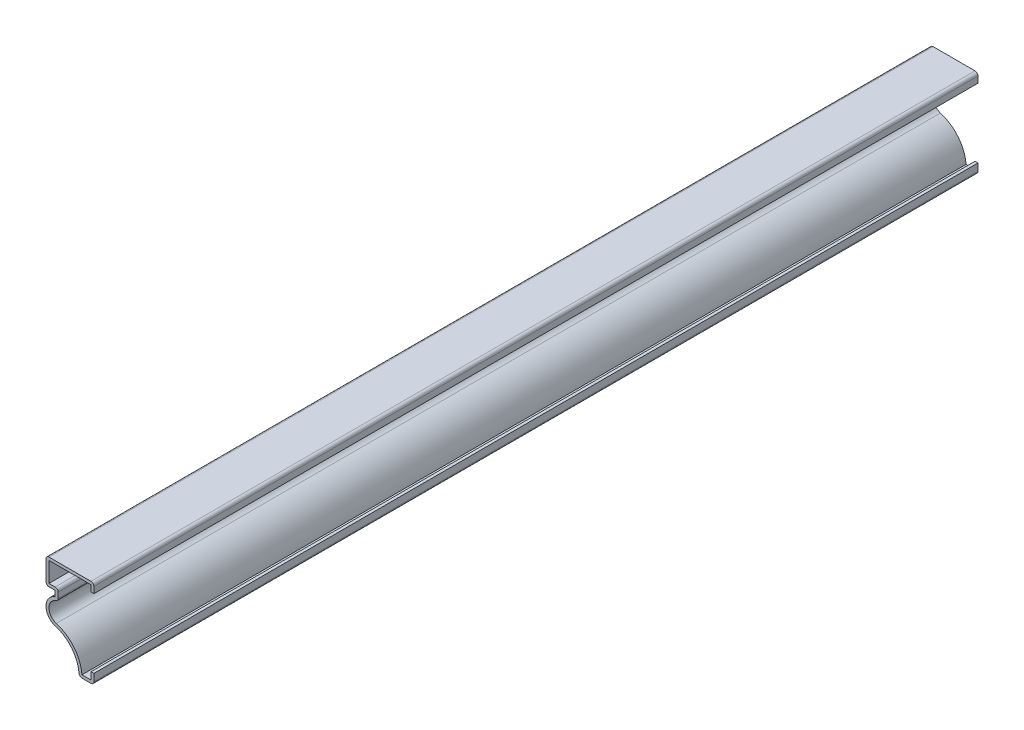
ISO-10303-21;
HEADER;
FILE_DESCRIPTION(('STEP AP214'),'2;1');
FILE_NAME('part.step','',(''),(''),'','','');
FILE_SCHEMA(('AUTOMOTIVE_DESIGN { 1 0 10303 214 1 1 1 1 }'));
ENDSEC;
DATA;
#1=APPLICATION_CONTEXT('core data for automotive mechanical design processes');
#2=APPLICATION_PROTOCOL_DEFINITION('international standard','automotive_design',2000,#1);
#3=PRODUCT_CONTEXT('',#1,'mechanical');
#4=PRODUCT('Part','Part','',(#3));
#5=PRODUCT_RELATED_PRODUCT_CATEGORY('part','',(#4));
#6=PRODUCT_DEFINITION_FORMATION('','',#4);
#7=PRODUCT_DEFINITION_CONTEXT('part definition',#1,'design');
#8=PRODUCT_DEFINITION('design','',#6,#7);
#9=PRODUCT_DEFINITION_SHAPE('','',#8);
#10=(LENGTH_UNIT() NAMED_UNIT(*) SI_UNIT(.MILLI.,.METRE.));
#11=(NAMED_UNIT(*) PLANE_ANGLE_UNIT() SI_UNIT($,.RADIAN.));
#12=(NAMED_UNIT(*) SI_UNIT($,.STERADIAN.) SOLID_ANGLE_UNIT());
#13=UNCERTAINTY_MEASURE_WITH_UNIT(LENGTH_MEASURE(1.E-05),#10,'distance_accuracy_value','');
#14=(GEOMETRIC_REPRESENTATION_CONTEXT(3) GLOBAL_UNCERTAINTY_ASSIGNED_CONTEXT((#13)) GLOBAL_UNIT_ASSIGNED_CONTEXT((#10,
#11,#12)) REPRESENTATION_CONTEXT('',''));
#15=CARTESIAN_POINT('',(0.,0.,0.));
#16=DIRECTION('',(0.,0.,1.));
#17=DIRECTION('',(1.,0.,0.));
#18=AXIS2_PLACEMENT_3D('',#15,#16,#17);
#19=CARTESIAN_POINT('',(0.,0.,-381.));
#20=DIRECTION('',(1.,0.,0.));
#21=DIRECTION('',(0.,0.,-1.));
#22=AXIS2_PLACEMENT_3D('',#19,#20,#21);
#23=PLANE('',#22);
#24=DIRECTION('',(0.,1.,0.));
#25=VECTOR('',#24,1.);
#26=CARTESIAN_POINT('',(0.,0.,0.));
#27=LINE('',#26,#25);
#28=CARTESIAN_POINT('',(0.,1.27,0.));
#29=VERTEX_POINT('',#28);
#30=CARTESIAN_POINT('',(0.,4.365625,0.));
#31=VERTEX_POINT('',#30);
#32=EDGE_CURVE('E380',#29,#31,#27,.T.);
#33=ORIENTED_EDGE('',*,*,#32,.F.);
#34=DIRECTION('',(0.,0.,1.));
#35=VECTOR('',#34,1.);
#36=CARTESIAN_POINT('',(0.,1.27,-381.));
#37=LINE('',#36,#35);
#38=CARTESIAN_POINT('',(0.,1.27,-381.));
#39=VERTEX_POINT('',#38);
#40=EDGE_CURVE('E222',#29,#39,#37,.F.);
#41=ORIENTED_EDGE('',*,*,#40,.T.);
#42=DIRECTION('',(0.,1.,0.));
#43=VECTOR('',#42,1.);
#44=CARTESIAN_POINT('',(0.,0.,-381.));
#45=LINE('',#44,#43);
#46=CARTESIAN_POINT('',(0.,4.365625,-381.));
#47=VERTEX_POINT('',#46);
#48=EDGE_CURVE('E215',#39,#47,#45,.T.);
#49=ORIENTED_EDGE('',*,*,#48,.T.);
#50=DIRECTION('',(0.,0.,1.));
#51=VECTOR('',#50,1.);
#52=CARTESIAN_POINT('',(0.,4.365625,-381.));
#53=LINE('',#52,#51);
#54=EDGE_CURVE('E219',#47,#31,#53,.T.);
#55=ORIENTED_EDGE('',*,*,#54,.T.);
#56=EDGE_LOOP('',(#33,#41,#49,#55));
#57=FACE_BOUND('',#56,.T.);
#58=ADVANCED_FACE('F35',(#57),#23,.T.);
#59=CARTESIAN_POINT('',(-6.35,0.,-381.));
#60=DIRECTION('',(0.,-1.,0.));
#61=DIRECTION('',(0.,0.,-1.));
#62=AXIS2_PLACEMENT_3D('',#59,#60,#61);
#63=PLANE('',#62);
#64=DIRECTION('',(1.,0.,0.));
#65=VECTOR('',#64,1.);
#66=CARTESIAN_POINT('',(-6.35,0.,-381.));
#67=LINE('',#66,#65);
#68=CARTESIAN_POINT('',(-5.13192338221503,0.,-381.));
#69=VERTEX_POINT('',#68);
#70=CARTESIAN_POINT('',(-1.27,0.,-381.));
#71=VERTEX_POINT('',#70);
#72=EDGE_CURVE('E240',#69,#71,#67,.T.);
#73=ORIENTED_EDGE('',*,*,#72,.T.);
#74=DIRECTION('',(0.,0.,1.));
#75=VECTOR('',#74,1.);
#76=CARTESIAN_POINT('',(-1.27,0.,-381.));
#77=LINE('',#76,#75);
#78=CARTESIAN_POINT('',(-1.27,0.,0.));
#79=VERTEX_POINT('',#78);
#80=EDGE_CURVE('E287',#71,#79,#77,.T.);
#81=ORIENTED_EDGE('',*,*,#80,.T.);
#82=DIRECTION('',(1.,0.,0.));
#83=VECTOR('',#82,1.);
#84=CARTESIAN_POINT('',(-6.35,0.,0.));
#85=LINE('',#84,#83);
#86=CARTESIAN_POINT('',(-5.13192338221503,0.,0.));
#87=VERTEX_POINT('',#86);
#88=EDGE_CURVE('E225',#87,#79,#85,.T.);
#89=ORIENTED_EDGE('',*,*,#88,.F.);
#90=DIRECTION('',(0.,0.,1.));
#91=VECTOR('',#90,1.);
#92=CARTESIAN_POINT('',(-5.13192338221503,0.,-381.));
#93=LINE('',#92,#91);
#94=EDGE_CURVE('E285',#87,#69,#93,.F.);
#95=ORIENTED_EDGE('',*,*,#94,.T.);
#96=EDGE_LOOP('',(#73,#81,#89,#95));
#97=FACE_BOUND('',#96,.T.);
#98=ADVANCED_FACE('F441',(#97),#63,.T.);
#99=CARTESIAN_POINT('',(-20.6375,0.,-381.));
#100=DIRECTION('',(0.,0.,1.));
#101=DIRECTION('',(1.,0.,0.));
#102=AXIS2_PLACEMENT_3D('',#99,#100,#101);
#103=CYLINDRICAL_SURFACE('',#102,14.2875);
#104=CARTESIAN_POINT('',(-20.6375,0.,-381.));
#105=DIRECTION('',(0.,0.,-1.));
#106=DIRECTION('',(-1.,0.,0.));
#107=AXIS2_PLACEMENT_3D('',#104,#105,#106);
#108=CIRCLE('',#107,14.2875);
#109=CARTESIAN_POINT('',(-16.5567820989189,13.6923481427327,-381.));
#110=VERTEX_POINT('',#109);
#111=CARTESIAN_POINT('',(-6.39768473876891,1.16632653061224,-381.));
#112=VERTEX_POINT('',#111);
#113=EDGE_CURVE('E245',#110,#112,#108,.T.);
#114=ORIENTED_EDGE('',*,*,#113,.T.);
#115=DIRECTION('',(0.,0.,1.));
#116=VECTOR('',#115,1.);
#117=CARTESIAN_POINT('',(-6.3976847387689,1.16632653061224,-381.));
#118=LINE('',#117,#116);
#119=CARTESIAN_POINT('',(-6.39768473876891,1.16632653061224,0.));
#120=VERTEX_POINT('',#119);
#121=EDGE_CURVE('E291',#112,#120,#118,.T.);
#122=ORIENTED_EDGE('',*,*,#121,.T.);
#123=CARTESIAN_POINT('',(-20.6375,0.,0.));
#124=DIRECTION('',(0.,0.,-1.));
#125=DIRECTION('',(-1.,0.,0.));
#126=AXIS2_PLACEMENT_3D('',#123,#124,#125);
#127=CIRCLE('',#126,14.2875);
#128=CARTESIAN_POINT('',(-16.5567820989189,13.6923481427327,0.));
#129=VERTEX_POINT('',#128);
#130=EDGE_CURVE('E336',#129,#120,#127,.T.);
#131=ORIENTED_EDGE('',*,*,#130,.F.);
#132=DIRECTION('',(0.,0.,1.));
#133=VECTOR('',#132,1.);
#134=CARTESIAN_POINT('',(-16.5567820989189,13.6923481427327,-381.));
#135=LINE('',#134,#133);
#136=EDGE_CURVE('E253',#110,#129,#135,.T.);
#137=ORIENTED_EDGE('',*,*,#136,.F.);
#138=EDGE_LOOP('',(#114,#122,#131,#137));
#139=FACE_BOUND('',#138,.T.);
#140=ADVANCED_FACE('F450',(#139),#103,.F.);
#141=CARTESIAN_POINT('',(-14.9252925239659,19.1666111996272,-381.));
#142=DIRECTION('',(0.,0.,1.));
#143=DIRECTION('',(1.,0.,0.));
#144=AXIS2_PLACEMENT_3D('',#141,#142,#143);
#145=CYLINDRICAL_SURFACE('',#144,5.71220747603415);
#146=CARTESIAN_POINT('',(-14.9252925239659,19.1666111996272,0.));
#147=DIRECTION('',(0.,0.,1.));
#148=DIRECTION('',(1.,0.,0.));
#149=AXIS2_PLACEMENT_3D('',#146,#147,#148);
#150=CIRCLE('',#149,5.71220747603415);
#151=CARTESIAN_POINT('',(-16.66875,24.60625,0.));
#152=VERTEX_POINT('',#151);
#153=EDGE_CURVE('E333',#152,#129,#150,.T.);
#154=ORIENTED_EDGE('',*,*,#153,.F.);
#155=DIRECTION('',(0.,0.,1.));
#156=VECTOR('',#155,1.);
#157=CARTESIAN_POINT('',(-16.66875,24.60625,-381.));
#158=LINE('',#157,#156);
#159=CARTESIAN_POINT('',(-16.66875,24.60625,-381.));
#160=VERTEX_POINT('',#159);
#161=EDGE_CURVE('E342',#160,#152,#158,.T.);
#162=ORIENTED_EDGE('',*,*,#161,.F.);
#163=CARTESIAN_POINT('',(-14.9252925239659,19.1666111996272,-381.));
#164=DIRECTION('',(0.,0.,1.));
#165=DIRECTION('',(1.,0.,0.));
#166=AXIS2_PLACEMENT_3D('',#163,#164,#165);
#167=CIRCLE('',#166,5.71220747603415);
#168=EDGE_CURVE('E431',#160,#110,#167,.T.);
#169=ORIENTED_EDGE('',*,*,#168,.T.);
#170=ORIENTED_EDGE('',*,*,#136,.T.);
#171=EDGE_LOOP('',(#154,#162,#169,#170));
#172=FACE_BOUND('',#171,.T.);
#173=ADVANCED_FACE('F454',(#172),#145,.T.);
#174=CARTESIAN_POINT('',(-16.66875,26.9875,-381.));
#175=DIRECTION('',(-1.,0.,0.));
#176=DIRECTION('',(0.,0.,1.));
#177=AXIS2_PLACEMENT_3D('',#174,#175,#176);
#178=PLANE('',#177);
#179=DIRECTION('',(0.,-1.,0.));
#180=VECTOR('',#179,1.);
#181=CARTESIAN_POINT('',(-16.66875,26.9875,0.));
#182=LINE('',#181,#180);
#183=CARTESIAN_POINT('',(-16.66875,26.9875,0.));
#184=VERTEX_POINT('',#183);
#185=EDGE_CURVE('E325',#184,#152,#182,.T.);
#186=ORIENTED_EDGE('',*,*,#185,.F.);
#187=DIRECTION('',(0.,0.,1.));
#188=VECTOR('',#187,1.);
#189=CARTESIAN_POINT('',(-16.66875,26.9875,-381.));
#190=LINE('',#189,#188);
#191=CARTESIAN_POINT('',(-16.66875,26.9875,-381.));
#192=VERTEX_POINT('',#191);
#193=EDGE_CURVE('E344',#192,#184,#190,.T.);
#194=ORIENTED_EDGE('',*,*,#193,.F.);
#195=DIRECTION('',(0.,-1.,0.));
#196=VECTOR('',#195,1.);
#197=CARTESIAN_POINT('',(-16.66875,26.9875,-381.));
#198=LINE('',#197,#196);
#199=EDGE_CURVE('E428',#192,#160,#198,.T.);
#200=ORIENTED_EDGE('',*,*,#199,.T.);
#201=ORIENTED_EDGE('',*,*,#161,.T.);
#202=EDGE_LOOP('',(#186,#194,#200,#201));
#203=FACE_BOUND('',#202,.T.);
#204=ADVANCED_FACE('F460',(#203),#178,.T.);
#205=CARTESIAN_POINT('',(-20.6375,26.9875,-381.));
#206=DIRECTION('',(0.,-1.,0.));
#207=DIRECTION('',(0.,0.,-1.));
#208=AXIS2_PLACEMENT_3D('',#205,#206,#207);
#209=PLANE('',#208);
#210=DIRECTION('',(1.,0.,0.));
#211=VECTOR('',#210,1.);
#212=CARTESIAN_POINT('',(-20.6375,26.9875,0.));
#213=LINE('',#212,#211);
#214=CARTESIAN_POINT('',(-19.3675,26.9875,0.));
#215=VERTEX_POINT('',#214);
#216=EDGE_CURVE('E322',#215,#184,#213,.T.);
#217=ORIENTED_EDGE('',*,*,#216,.F.);
#218=DIRECTION('',(0.,0.,1.));
#219=VECTOR('',#218,1.);
#220=CARTESIAN_POINT('',(-19.3675,26.9875,-381.));
#221=LINE('',#220,#219);
#222=CARTESIAN_POINT('',(-19.3675,26.9875,-381.));
#223=VERTEX_POINT('',#222);
#224=EDGE_CURVE('E11',#215,#223,#221,.F.);
#225=ORIENTED_EDGE('',*,*,#224,.T.);
#226=DIRECTION('',(1.,0.,0.));
#227=VECTOR('',#226,1.);
#228=CARTESIAN_POINT('',(-20.6375,26.9875,-381.));
#229=LINE('',#228,#227);
#230=EDGE_CURVE('E421',#223,#192,#229,.T.);
#231=ORIENTED_EDGE('',*,*,#230,.T.);
#232=ORIENTED_EDGE('',*,*,#193,.T.);
#233=EDGE_LOOP('',(#217,#225,#231,#232));
#234=FACE_BOUND('',#233,.T.);
#235=ADVANCED_FACE('F462',(#234),#209,.T.);
#236=CARTESIAN_POINT('',(-20.6375,38.1,-381.));
#237=DIRECTION('',(-1.,0.,0.));
#238=DIRECTION('',(0.,0.,1.));
#239=AXIS2_PLACEMENT_3D('',#236,#237,#238);
#240=PLANE('',#239);
#241=DIRECTION('',(0.,-1.,0.));
#242=VECTOR('',#241,1.);
#243=CARTESIAN_POINT('',(-20.6375,38.1,-381.));
#244=LINE('',#243,#242);
#245=CARTESIAN_POINT('',(-20.6375,36.83,-381.));
#246=VERTEX_POINT('',#245);
#247=CARTESIAN_POINT('',(-20.6375,28.2575,-381.));
#248=VERTEX_POINT('',#247);
#249=EDGE_CURVE('E314',#246,#248,#244,.T.);
#250=ORIENTED_EDGE('',*,*,#249,.T.);
#251=DIRECTION('',(0.,0.,1.));
#252=VECTOR('',#251,1.);
#253=CARTESIAN_POINT('',(-20.6375,28.2575,-381.));
#254=LINE('',#253,#252);
#255=CARTESIAN_POINT('',(-20.6375,28.2575,0.));
#256=VERTEX_POINT('',#255);
#257=EDGE_CURVE('E43',#248,#256,#254,.T.);
#258=ORIENTED_EDGE('',*,*,#257,.T.);
#259=DIRECTION('',(0.,-1.,0.));
#260=VECTOR('',#259,1.);
#261=CARTESIAN_POINT('',(-20.6375,38.1,0.));
#262=LINE('',#261,#260);
#263=CARTESIAN_POINT('',(-20.6375,36.83,0.));
#264=VERTEX_POINT('',#263);
#265=EDGE_CURVE('E311',#264,#256,#262,.T.);
#266=ORIENTED_EDGE('',*,*,#265,.F.);
#267=DIRECTION('',(0.,0.,1.));
#268=VECTOR('',#267,1.);
#269=CARTESIAN_POINT('',(-20.6375,36.83,-381.));
#270=LINE('',#269,#268);
#271=EDGE_CURVE('E303',#264,#246,#270,.F.);
#272=ORIENTED_EDGE('',*,*,#271,.T.);
#273=EDGE_LOOP('',(#250,#258,#266,#272));
#274=FACE_BOUND('',#273,.T.);
#275=ADVANCED_FACE('F310',(#274),#240,.T.);
#276=CARTESIAN_POINT('',(0.,38.1,-381.));
#277=DIRECTION('',(0.,1.,0.));
#278=DIRECTION('',(0.,0.,1.));
#279=AXIS2_PLACEMENT_3D('',#276,#277,#278);
#280=PLANE('',#279);
#281=DIRECTION('',(-1.,0.,0.));
#282=VECTOR('',#281,1.);
#283=CARTESIAN_POINT('',(0.,38.1,0.));
#284=LINE('',#283,#282);
#285=CARTESIAN_POINT('',(-1.27,38.1,0.));
#286=VERTEX_POINT('',#285);
#287=CARTESIAN_POINT('',(-19.3675,38.1,0.));
#288=VERTEX_POINT('',#287);
#289=EDGE_CURVE('E323',#286,#288,#284,.T.);
#290=ORIENTED_EDGE('',*,*,#289,.F.);
#291=DIRECTION('',(0.,0.,1.));
#292=VECTOR('',#291,1.);
#293=CARTESIAN_POINT('',(-1.27,38.1,-381.));
#294=LINE('',#293,#292);
#295=CARTESIAN_POINT('',(-1.27,38.1,-381.));
#296=VERTEX_POINT('',#295);
#297=EDGE_CURVE('E270',#286,#296,#294,.F.);
#298=ORIENTED_EDGE('',*,*,#297,.T.);
#299=DIRECTION('',(-1.,0.,0.));
#300=VECTOR('',#299,1.);
#301=CARTESIAN_POINT('',(0.,38.1,-381.));
#302=LINE('',#301,#300);
#303=CARTESIAN_POINT('',(-19.3675,38.1,-381.));
#304=VERTEX_POINT('',#303);
#305=EDGE_CURVE('E417',#296,#304,#302,.T.);
#306=ORIENTED_EDGE('',*,*,#305,.T.);
#307=DIRECTION('',(0.,0.,1.));
#308=VECTOR('',#307,1.);
#309=CARTESIAN_POINT('',(-19.3675,38.1,-381.));
#310=LINE('',#309,#308);
#311=EDGE_CURVE('E267',#304,#288,#310,.T.);
#312=ORIENTED_EDGE('',*,*,#311,.T.);
#313=EDGE_LOOP('',(#290,#298,#306,#312));
#314=FACE_BOUND('',#313,.T.);
#315=ADVANCED_FACE('F416',(#314),#280,.T.);
#316=CARTESIAN_POINT('',(0.,34.13125,-381.));
#317=DIRECTION('',(1.,0.,0.));
#318=DIRECTION('',(0.,0.,-1.));
#319=AXIS2_PLACEMENT_3D('',#316,#317,#318);
#320=PLANE('',#319);
#321=DIRECTION('',(0.,1.,0.));
#322=VECTOR('',#321,1.);
#323=CARTESIAN_POINT('',(0.,34.13125,-381.));
#324=LINE('',#323,#322);
#325=CARTESIAN_POINT('',(0.,34.13125,-381.));
#326=VERTEX_POINT('',#325);
#327=CARTESIAN_POINT('',(0.,36.83,-381.));
#328=VERTEX_POINT('',#327);
#329=EDGE_CURVE('E409',#326,#328,#324,.T.);
#330=ORIENTED_EDGE('',*,*,#329,.T.);
#331=DIRECTION('',(0.,0.,1.));
#332=VECTOR('',#331,1.);
#333=CARTESIAN_POINT('',(0.,36.83,-381.));
#334=LINE('',#333,#332);
#335=CARTESIAN_POINT('',(0.,36.83,0.));
#336=VERTEX_POINT('',#335);
#337=EDGE_CURVE('E249',#328,#336,#334,.T.);
#338=ORIENTED_EDGE('',*,*,#337,.T.);
#339=DIRECTION('',(0.,1.,0.));
#340=VECTOR('',#339,1.);
#341=CARTESIAN_POINT('',(0.,34.13125,0.));
#342=LINE('',#341,#340);
#343=CARTESIAN_POINT('',(0.,34.13125,0.));
#344=VERTEX_POINT('',#343);
#345=EDGE_CURVE('E327',#344,#336,#342,.T.);
#346=ORIENTED_EDGE('',*,*,#345,.F.);
#347=DIRECTION('',(0.,0.,1.));
#348=VECTOR('',#347,1.);
#349=CARTESIAN_POINT('',(0.,34.13125,-381.));
#350=LINE('',#349,#348);
#351=EDGE_CURVE('E347',#326,#344,#350,.T.);
#352=ORIENTED_EDGE('',*,*,#351,.F.);
#353=EDGE_LOOP('',(#330,#338,#346,#352));
#354=FACE_BOUND('',#353,.T.);
#355=ADVANCED_FACE('F405',(#354),#320,.T.);
#356=CARTESIAN_POINT('',(0.,34.13125,-381.));
#357=DIRECTION('',(0.,1.,0.));
#358=DIRECTION('',(0.,0.,1.));
#359=AXIS2_PLACEMENT_3D('',#356,#357,#358);
#360=PLANE('',#359);
#361=DIRECTION('',(-1.,0.,0.));
#362=VECTOR('',#361,1.);
#363=CARTESIAN_POINT('',(0.,34.13125,0.));
#364=LINE('',#363,#362);
#365=CARTESIAN_POINT('',(-1.27,34.13125,0.));
#366=VERTEX_POINT('',#365);
#367=EDGE_CURVE('E398',#344,#366,#364,.T.);
#368=ORIENTED_EDGE('',*,*,#367,.T.);
#369=DIRECTION('',(0.,0.,1.));
#370=VECTOR('',#369,1.);
#371=CARTESIAN_POINT('',(-1.27,34.13125,-381.));
#372=LINE('',#371,#370);
#373=CARTESIAN_POINT('',(-1.27,34.13125,-381.));
#374=VERTEX_POINT('',#373);
#375=EDGE_CURVE('E349',#374,#366,#372,.T.);
#376=ORIENTED_EDGE('',*,*,#375,.F.);
#377=DIRECTION('',(-1.,0.,0.));
#378=VECTOR('',#377,1.);
#379=CARTESIAN_POINT('',(0.,34.13125,-381.));
#380=LINE('',#379,#378);
#381=EDGE_CURVE('E423',#326,#374,#380,.T.);
#382=ORIENTED_EDGE('',*,*,#381,.F.);
#383=ORIENTED_EDGE('',*,*,#351,.T.);
#384=EDGE_LOOP('',(#368,#376,#382,#383));
#385=FACE_BOUND('',#384,.T.);
#386=ADVANCED_FACE('F527',(#385),#360,.F.);
#387=CARTESIAN_POINT('',(-1.27,34.13125,-381.));
#388=DIRECTION('',(1.,0.,0.));
#389=DIRECTION('',(0.,0.,-1.));
#390=AXIS2_PLACEMENT_3D('',#387,#388,#389);
#391=PLANE('',#390);
#392=DIRECTION('',(0.,1.,0.));
#393=VECTOR('',#392,1.);
#394=CARTESIAN_POINT('',(-1.27,34.13125,0.));
#395=LINE('',#394,#393);
#396=CARTESIAN_POINT('',(-1.27,36.83,0.));
#397=VERTEX_POINT('',#396);
#398=EDGE_CURVE('E396',#366,#397,#395,.T.);
#399=ORIENTED_EDGE('',*,*,#398,.T.);
#400=DIRECTION('',(0.,0.,1.));
#401=VECTOR('',#400,1.);
#402=CARTESIAN_POINT('',(-1.27,36.83,-381.));
#403=LINE('',#402,#401);
#404=CARTESIAN_POINT('',(-1.27,36.83,-381.));
#405=VERTEX_POINT('',#404);
#406=EDGE_CURVE('E352',#405,#397,#403,.T.);
#407=ORIENTED_EDGE('',*,*,#406,.F.);
#408=DIRECTION('',(0.,1.,0.));
#409=VECTOR('',#408,1.);
#410=CARTESIAN_POINT('',(-1.27,34.13125,-381.));
#411=LINE('',#410,#409);
#412=EDGE_CURVE('E522',#374,#405,#411,.T.);
#413=ORIENTED_EDGE('',*,*,#412,.F.);
#414=ORIENTED_EDGE('',*,*,#375,.T.);
#415=EDGE_LOOP('',(#399,#407,#413,#414));
#416=FACE_BOUND('',#415,.T.);
#417=ADVANCED_FACE('F529',(#416),#391,.F.);
#418=CARTESIAN_POINT('',(0.,36.83,-381.));
#419=DIRECTION('',(0.,1.,0.));
#420=DIRECTION('',(0.,0.,1.));
#421=AXIS2_PLACEMENT_3D('',#418,#419,#420);
#422=PLANE('',#421);
#423=DIRECTION('',(1.,0.,0.));
#424=VECTOR('',#423,1.);
#425=CARTESIAN_POINT('',(0.,36.83,0.));
#426=LINE('',#425,#424);
#427=CARTESIAN_POINT('',(-19.3675,36.83,0.));
#428=VERTEX_POINT('',#427);
#429=EDGE_CURVE('E394',#397,#428,#426,.F.);
#430=ORIENTED_EDGE('',*,*,#429,.T.);
#431=DIRECTION('',(0.,0.,1.));
#432=VECTOR('',#431,1.);
#433=CARTESIAN_POINT('',(-19.3675,36.83,-381.));
#434=LINE('',#433,#432);
#435=CARTESIAN_POINT('',(-19.3675,36.83,-381.));
#436=VERTEX_POINT('',#435);
#437=EDGE_CURVE('E355',#436,#428,#434,.T.);
#438=ORIENTED_EDGE('',*,*,#437,.F.);
#439=DIRECTION('',(1.,0.,0.));
#440=VECTOR('',#439,1.);
#441=CARTESIAN_POINT('',(0.,36.83,-381.));
#442=LINE('',#441,#440);
#443=EDGE_CURVE('E520',#405,#436,#442,.F.);
#444=ORIENTED_EDGE('',*,*,#443,.F.);
#445=ORIENTED_EDGE('',*,*,#406,.T.);
#446=EDGE_LOOP('',(#430,#438,#444,#445));
#447=FACE_BOUND('',#446,.T.);
#448=ADVANCED_FACE('F534',(#447),#422,.F.);
#449=CARTESIAN_POINT('',(-19.3675,38.1,-381.));
#450=DIRECTION('',(-1.,0.,0.));
#451=DIRECTION('',(0.,0.,1.));
#452=AXIS2_PLACEMENT_3D('',#449,#450,#451);
#453=PLANE('',#452);
#454=DIRECTION('',(0.,1.,0.));
#455=VECTOR('',#454,1.);
#456=CARTESIAN_POINT('',(-19.3675,38.1,0.));
#457=LINE('',#456,#455);
#458=CARTESIAN_POINT('',(-19.3675,28.2575,0.));
#459=VERTEX_POINT('',#458);
#460=EDGE_CURVE('E392',#428,#459,#457,.F.);
#461=ORIENTED_EDGE('',*,*,#460,.T.);
#462=DIRECTION('',(0.,0.,1.));
#463=VECTOR('',#462,1.);
#464=CARTESIAN_POINT('',(-19.3675,28.2575,-381.));
#465=LINE('',#464,#463);
#466=CARTESIAN_POINT('',(-19.3675,28.2575,-381.));
#467=VERTEX_POINT('',#466);
#468=EDGE_CURVE('E358',#467,#459,#465,.T.);
#469=ORIENTED_EDGE('',*,*,#468,.F.);
#470=DIRECTION('',(0.,1.,0.));
#471=VECTOR('',#470,1.);
#472=CARTESIAN_POINT('',(-19.3675,38.1,-381.));
#473=LINE('',#472,#471);
#474=EDGE_CURVE('E518',#436,#467,#473,.F.);
#475=ORIENTED_EDGE('',*,*,#474,.F.);
#476=ORIENTED_EDGE('',*,*,#437,.T.);
#477=EDGE_LOOP('',(#461,#469,#475,#476));
#478=FACE_BOUND('',#477,.T.);
#479=ADVANCED_FACE('F540',(#478),#453,.F.);
#480=CARTESIAN_POINT('',(-20.6375,28.2575,-381.));
#481=DIRECTION('',(0.,-1.,0.));
#482=DIRECTION('',(0.,0.,-1.));
#483=AXIS2_PLACEMENT_3D('',#480,#481,#482);
#484=PLANE('',#483);
#485=DIRECTION('',(1.,0.,0.));
#486=VECTOR('',#485,1.);
#487=CARTESIAN_POINT('',(-20.6375,28.2575,0.));
#488=LINE('',#487,#486);
#489=CARTESIAN_POINT('',(-16.66875,28.2575,0.));
#490=VERTEX_POINT('',#489);
#491=EDGE_CURVE('E389',#459,#490,#488,.T.);
#492=ORIENTED_EDGE('',*,*,#491,.T.);
#493=DIRECTION('',(0.,0.,1.));
#494=VECTOR('',#493,1.);
#495=CARTESIAN_POINT('',(-16.66875,28.2575,-381.));
#496=LINE('',#495,#494);
#497=CARTESIAN_POINT('',(-16.66875,28.2575,-381.));
#498=VERTEX_POINT('',#497);
#499=EDGE_CURVE('E301',#490,#498,#496,.F.);
#500=ORIENTED_EDGE('',*,*,#499,.T.);
#501=DIRECTION('',(1.,0.,0.));
#502=VECTOR('',#501,1.);
#503=CARTESIAN_POINT('',(-20.6375,28.2575,-381.));
#504=LINE('',#503,#502);
#505=EDGE_CURVE('E515',#467,#498,#504,.T.);
#506=ORIENTED_EDGE('',*,*,#505,.F.);
#507=ORIENTED_EDGE('',*,*,#468,.T.);
#508=EDGE_LOOP('',(#492,#500,#506,#507));
#509=FACE_BOUND('',#508,.T.);
#510=ADVANCED_FACE('F544',(#509),#484,.F.);
#511=CARTESIAN_POINT('',(-15.39875,26.9875,-381.));
#512=DIRECTION('',(-1.,0.,0.));
#513=DIRECTION('',(0.,0.,1.));
#514=AXIS2_PLACEMENT_3D('',#511,#512,#513);
#515=PLANE('',#514);
#516=DIRECTION('',(0.,1.,0.));
#517=VECTOR('',#516,1.);
#518=CARTESIAN_POINT('',(-15.39875,26.9875,0.));
#519=LINE('',#518,#517);
#520=CARTESIAN_POINT('',(-15.39875,26.9875,0.));
#521=VERTEX_POINT('',#520);
#522=CARTESIAN_POINT('',(-15.39875,24.60625,0.));
#523=VERTEX_POINT('',#522);
#524=EDGE_CURVE('E387',#521,#523,#519,.F.);
#525=ORIENTED_EDGE('',*,*,#524,.T.);
#526=DIRECTION('',(0.,0.,1.));
#527=VECTOR('',#526,1.);
#528=CARTESIAN_POINT('',(-15.39875,24.60625,-381.));
#529=LINE('',#528,#527);
#530=CARTESIAN_POINT('',(-15.39875,24.60625,-381.));
#531=VERTEX_POINT('',#530);
#532=EDGE_CURVE('E58',#523,#531,#529,.F.);
#533=ORIENTED_EDGE('',*,*,#532,.T.);
#534=DIRECTION('',(0.,1.,0.));
#535=VECTOR('',#534,1.);
#536=CARTESIAN_POINT('',(-15.39875,26.9875,-381.));
#537=LINE('',#536,#535);
#538=CARTESIAN_POINT('',(-15.39875,26.9875,-381.));
#539=VERTEX_POINT('',#538);
#540=EDGE_CURVE('E513',#539,#531,#537,.F.);
#541=ORIENTED_EDGE('',*,*,#540,.F.);
#542=DIRECTION('',(0.,0.,1.));
#543=VECTOR('',#542,1.);
#544=CARTESIAN_POINT('',(-15.39875,26.9875,-381.));
#545=LINE('',#544,#543);
#546=EDGE_CURVE('E297',#539,#521,#545,.T.);
#547=ORIENTED_EDGE('',*,*,#546,.T.);
#548=EDGE_LOOP('',(#525,#533,#541,#547));
#549=FACE_BOUND('',#548,.T.);
#550=ADVANCED_FACE('F547',(#549),#515,.F.);
#551=CARTESIAN_POINT('',(-14.9252925239659,19.1666111996272,-381.));
#552=DIRECTION('',(0.,0.,1.));
#553=DIRECTION('',(1.,0.,0.));
#554=AXIS2_PLACEMENT_3D('',#551,#552,#553);
#555=CYLINDRICAL_SURFACE('',#554,4.44220747603415);
#556=CARTESIAN_POINT('',(-14.9252925239659,19.1666111996272,-381.));
#557=DIRECTION('',(0.,0.,1.));
#558=DIRECTION('',(1.,0.,0.));
#559=AXIS2_PLACEMENT_3D('',#556,#557,#558);
#560=CIRCLE('',#559,4.44220747603415);
#561=CARTESIAN_POINT('',(-16.2811256001768,23.3968504280381,-381.));
#562=VERTEX_POINT('',#561);
#563=CARTESIAN_POINT('',(-16.1940516188228,14.9094457554201,-381.));
#564=VERTEX_POINT('',#563);
#565=EDGE_CURVE('E499',#562,#564,#560,.T.);
#566=ORIENTED_EDGE('',*,*,#565,.F.);
#567=DIRECTION('',(0.,0.,1.));
#568=VECTOR('',#567,1.);
#569=CARTESIAN_POINT('',(-16.2811256001768,23.3968504280381,-381.));
#570=LINE('',#569,#568);
#571=CARTESIAN_POINT('',(-16.2811256001768,23.3968504280381,0.));
#572=VERTEX_POINT('',#571);
#573=EDGE_CURVE('E294',#562,#572,#570,.T.);
#574=ORIENTED_EDGE('',*,*,#573,.T.);
#575=CARTESIAN_POINT('',(-14.9252925239659,19.1666111996272,0.));
#576=DIRECTION('',(0.,0.,1.));
#577=DIRECTION('',(1.,0.,0.));
#578=AXIS2_PLACEMENT_3D('',#575,#576,#577);
#579=CIRCLE('',#578,4.44220747603415);
#580=CARTESIAN_POINT('',(-16.1940516188228,14.9094457554201,0.));
#581=VERTEX_POINT('',#580);
#582=EDGE_CURVE('E385',#572,#581,#579,.T.);
#583=ORIENTED_EDGE('',*,*,#582,.T.);
#584=DIRECTION('',(0.,0.,1.));
#585=VECTOR('',#584,1.);
#586=CARTESIAN_POINT('',(-16.1940516188228,14.9094457554201,-381.));
#587=LINE('',#586,#585);
#588=EDGE_CURVE('E361',#564,#581,#587,.T.);
#589=ORIENTED_EDGE('',*,*,#588,.F.);
#590=EDGE_LOOP('',(#566,#574,#583,#589));
#591=FACE_BOUND('',#590,.T.);
#592=ADVANCED_FACE('F497',(#591),#555,.F.);
#593=CARTESIAN_POINT('',(-20.6375,0.,-381.));
#594=DIRECTION('',(0.,0.,1.));
#595=DIRECTION('',(1.,0.,0.));
#596=AXIS2_PLACEMENT_3D('',#593,#594,#595);
#597=CYLINDRICAL_SURFACE('',#596,15.5575);
#598=CARTESIAN_POINT('',(-20.6375,0.,0.));
#599=DIRECTION('',(0.,0.,1.));
#600=DIRECTION('',(1.,0.,0.));
#601=AXIS2_PLACEMENT_3D('',#598,#599,#600);
#602=CIRCLE('',#601,15.5575);
#603=CARTESIAN_POINT('',(-5.13192338221503,1.27,0.));
#604=VERTEX_POINT('',#603);
#605=EDGE_CURVE('E378',#581,#604,#602,.F.);
#606=ORIENTED_EDGE('',*,*,#605,.T.);
#607=DIRECTION('',(0.,0.,1.));
#608=VECTOR('',#607,1.);
#609=CARTESIAN_POINT('',(-5.13192338221503,1.27,-381.));
#610=LINE('',#609,#608);
#611=CARTESIAN_POINT('',(-5.13192338221503,1.27,-381.));
#612=VERTEX_POINT('',#611);
#613=EDGE_CURVE('E364',#612,#604,#610,.T.);
#614=ORIENTED_EDGE('',*,*,#613,.F.);
#615=CARTESIAN_POINT('',(-20.6375,0.,-381.));
#616=DIRECTION('',(0.,0.,1.));
#617=DIRECTION('',(1.,0.,0.));
#618=AXIS2_PLACEMENT_3D('',#615,#616,#617);
#619=CIRCLE('',#618,15.5575);
#620=EDGE_CURVE('E507',#564,#612,#619,.F.);
#621=ORIENTED_EDGE('',*,*,#620,.F.);
#622=ORIENTED_EDGE('',*,*,#588,.T.);
#623=EDGE_LOOP('',(#606,#614,#621,#622));
#624=FACE_BOUND('',#623,.T.);
#625=ADVANCED_FACE('F503',(#624),#597,.T.);
#626=CARTESIAN_POINT('',(-6.35,1.27,-381.));
#627=DIRECTION('',(0.,-1.,0.));
#628=DIRECTION('',(0.,0.,-1.));
#629=AXIS2_PLACEMENT_3D('',#626,#627,#628);
#630=PLANE('',#629);
#631=DIRECTION('',(1.,0.,0.));
#632=VECTOR('',#631,1.);
#633=CARTESIAN_POINT('',(-6.35,1.27,0.));
#634=LINE('',#633,#632);
#635=CARTESIAN_POINT('',(-1.27,1.27,0.));
#636=VERTEX_POINT('',#635);
#637=EDGE_CURVE('E376',#604,#636,#634,.T.);
#638=ORIENTED_EDGE('',*,*,#637,.T.);
#639=DIRECTION('',(0.,0.,1.));
#640=VECTOR('',#639,1.);
#641=CARTESIAN_POINT('',(-1.27,1.27,-381.));
#642=LINE('',#641,#640);
#643=CARTESIAN_POINT('',(-1.27,1.27,-381.));
#644=VERTEX_POINT('',#643);
#645=EDGE_CURVE('E242',#644,#636,#642,.T.);
#646=ORIENTED_EDGE('',*,*,#645,.F.);
#647=DIRECTION('',(1.,0.,0.));
#648=VECTOR('',#647,1.);
#649=CARTESIAN_POINT('',(-6.35,1.27,-381.));
#650=LINE('',#649,#648);
#651=EDGE_CURVE('E506',#612,#644,#650,.T.);
#652=ORIENTED_EDGE('',*,*,#651,.F.);
#653=ORIENTED_EDGE('',*,*,#613,.T.);
#654=EDGE_LOOP('',(#638,#646,#652,#653));
#655=FACE_BOUND('',#654,.T.);
#656=ADVANCED_FACE('F505',(#655),#630,.F.);
#657=CARTESIAN_POINT('',(-1.27,0.,-381.));
#658=DIRECTION('',(1.,0.,0.));
#659=DIRECTION('',(0.,0.,-1.));
#660=AXIS2_PLACEMENT_3D('',#657,#658,#659);
#661=PLANE('',#660);
#662=DIRECTION('',(0.,1.,0.));
#663=VECTOR('',#662,1.);
#664=CARTESIAN_POINT('',(-1.27,0.,0.));
#665=LINE('',#664,#663);
#666=CARTESIAN_POINT('',(-1.27,4.365625,0.));
#667=VERTEX_POINT('',#666);
#668=EDGE_CURVE('E371',#636,#667,#665,.T.);
#669=ORIENTED_EDGE('',*,*,#668,.T.);
#670=DIRECTION('',(0.,0.,1.));
#671=VECTOR('',#670,1.);
#672=CARTESIAN_POINT('',(-1.27,4.365625,-381.));
#673=LINE('',#672,#671);
#674=CARTESIAN_POINT('',(-1.27,4.365625,-381.));
#675=VERTEX_POINT('',#674);
#676=EDGE_CURVE('E239',#675,#667,#673,.T.);
#677=ORIENTED_EDGE('',*,*,#676,.F.);
#678=DIRECTION('',(0.,1.,0.));
#679=VECTOR('',#678,1.);
#680=CARTESIAN_POINT('',(-1.27,0.,-381.));
#681=LINE('',#680,#679);
#682=EDGE_CURVE('E231',#644,#675,#681,.T.);
#683=ORIENTED_EDGE('',*,*,#682,.F.);
#684=ORIENTED_EDGE('',*,*,#645,.T.);
#685=EDGE_LOOP('',(#669,#677,#683,#684));
#686=FACE_BOUND('',#685,.T.);
#687=ADVANCED_FACE('F370',(#686),#661,.F.);
#688=CARTESIAN_POINT('',(-1.27,4.365625,-381.));
#689=DIRECTION('',(0.,-1.,0.));
#690=DIRECTION('',(0.,0.,-1.));
#691=AXIS2_PLACEMENT_3D('',#688,#689,#690);
#692=PLANE('',#691);
#693=DIRECTION('',(1.,0.,0.));
#694=VECTOR('',#693,1.);
#695=CARTESIAN_POINT('',(-1.27,4.365625,0.));
#696=LINE('',#695,#694);
#697=EDGE_CURVE('E238',#667,#31,#696,.T.);
#698=ORIENTED_EDGE('',*,*,#697,.T.);
#699=ORIENTED_EDGE('',*,*,#54,.F.);
#700=DIRECTION('',(1.,0.,0.));
#701=VECTOR('',#700,1.);
#702=CARTESIAN_POINT('',(-1.27,4.365625,-381.));
#703=LINE('',#702,#701);
#704=EDGE_CURVE('E224',#675,#47,#703,.T.);
#705=ORIENTED_EDGE('',*,*,#704,.F.);
#706=ORIENTED_EDGE('',*,*,#676,.T.);
#707=EDGE_LOOP('',(#698,#699,#705,#706));
#708=FACE_BOUND('',#707,.T.);
#709=ADVANCED_FACE('F236',(#708),#692,.F.);
#710=CARTESIAN_POINT('',(-20.6375,0.,-381.));
#711=DIRECTION('',(0.,0.,1.));
#712=DIRECTION('',(1.,0.,0.));
#713=AXIS2_PLACEMENT_3D('',#710,#711,#712);
#714=PLANE('',#713);
#715=ORIENTED_EDGE('',*,*,#305,.F.);
#716=CARTESIAN_POINT('',(-1.27,36.83,-381.));
#717=DIRECTION('',(0.,0.,1.));
#718=DIRECTION('',(1.,0.,0.));
#719=AXIS2_PLACEMENT_3D('',#716,#717,#718);
#720=CIRCLE('',#719,1.27);
#721=EDGE_CURVE('E283',#296,#328,#720,.F.);
#722=ORIENTED_EDGE('',*,*,#721,.T.);
#723=ORIENTED_EDGE('',*,*,#329,.F.);
#724=ORIENTED_EDGE('',*,*,#381,.T.);
#725=ORIENTED_EDGE('',*,*,#412,.T.);
#726=ORIENTED_EDGE('',*,*,#443,.T.);
#727=ORIENTED_EDGE('',*,*,#474,.T.);
#728=ORIENTED_EDGE('',*,*,#505,.T.);
#729=CARTESIAN_POINT('',(-16.66875,26.9875,-381.));
#730=DIRECTION('',(0.,0.,1.));
#731=DIRECTION('',(1.,0.,0.));
#732=AXIS2_PLACEMENT_3D('',#729,#730,#731);
#733=CIRCLE('',#732,1.27);
#734=EDGE_CURVE('E276',#498,#539,#733,.F.);
#735=ORIENTED_EDGE('',*,*,#734,.T.);
#736=ORIENTED_EDGE('',*,*,#540,.T.);
#737=CARTESIAN_POINT('',(-16.66875,24.60625,-381.));
#738=DIRECTION('',(0.,0.,1.));
#739=DIRECTION('',(1.,0.,0.));
#740=AXIS2_PLACEMENT_3D('',#737,#738,#739);
#741=CIRCLE('',#740,1.27);
#742=EDGE_CURVE('E50',#531,#562,#741,.F.);
#743=ORIENTED_EDGE('',*,*,#742,.T.);
#744=ORIENTED_EDGE('',*,*,#565,.T.);
#745=ORIENTED_EDGE('',*,*,#620,.T.);
#746=ORIENTED_EDGE('',*,*,#651,.T.);
#747=ORIENTED_EDGE('',*,*,#682,.T.);
#748=ORIENTED_EDGE('',*,*,#704,.T.);
#749=ORIENTED_EDGE('',*,*,#48,.F.);
#750=CARTESIAN_POINT('',(-1.27,1.27,-381.));
#751=DIRECTION('',(0.,0.,1.));
#752=DIRECTION('',(1.,0.,0.));
#753=AXIS2_PLACEMENT_3D('',#750,#751,#752);
#754=CIRCLE('',#753,1.27);
#755=EDGE_CURVE('E281',#39,#71,#754,.F.);
#756=ORIENTED_EDGE('',*,*,#755,.T.);
#757=ORIENTED_EDGE('',*,*,#72,.F.);
#758=CARTESIAN_POINT('',(-5.13192338221503,1.27,-381.));
#759=DIRECTION('',(0.,0.,1.));
#760=DIRECTION('',(1.,0.,0.));
#761=AXIS2_PLACEMENT_3D('',#758,#759,#760);
#762=CIRCLE('',#761,1.27);
#763=EDGE_CURVE('E279',#69,#112,#762,.F.);
#764=ORIENTED_EDGE('',*,*,#763,.T.);
#765=ORIENTED_EDGE('',*,*,#113,.F.);
#766=ORIENTED_EDGE('',*,*,#168,.F.);
#767=ORIENTED_EDGE('',*,*,#199,.F.);
#768=ORIENTED_EDGE('',*,*,#230,.F.);
#769=CARTESIAN_POINT('',(-19.3675,28.2575,-381.));
#770=DIRECTION('',(0.,0.,1.));
#771=DIRECTION('',(1.,0.,0.));
#772=AXIS2_PLACEMENT_3D('',#769,#770,#771);
#773=CIRCLE('',#772,1.27);
#774=EDGE_CURVE('E274',#223,#248,#773,.F.);
#775=ORIENTED_EDGE('',*,*,#774,.T.);
#776=ORIENTED_EDGE('',*,*,#249,.F.);
#777=CARTESIAN_POINT('',(-19.3675,36.83,-381.));
#778=DIRECTION('',(0.,0.,1.));
#779=DIRECTION('',(1.,0.,0.));
#780=AXIS2_PLACEMENT_3D('',#777,#778,#779);
#781=CIRCLE('',#780,1.27);
#782=EDGE_CURVE('E272',#246,#304,#781,.F.);
#783=ORIENTED_EDGE('',*,*,#782,.T.);
#784=EDGE_LOOP('',(#715,#722,#723,#724,#725,#726,#727,#728,#735,#736,#743,#744,#745,#746,#747,
#748,#749,#756,#757,#764,#765,#766,#767,#768,#775,#776,#783));
#785=FACE_BOUND('',#784,.T.);
#786=ADVANCED_FACE('F229',(#785),#714,.F.);
#787=CARTESIAN_POINT('',(-20.6375,0.,0.));
#788=DIRECTION('',(0.,0.,1.));
#789=DIRECTION('',(1.,0.,0.));
#790=AXIS2_PLACEMENT_3D('',#787,#788,#789);
#791=PLANE('',#790);
#792=ORIENTED_EDGE('',*,*,#345,.T.);
#793=CARTESIAN_POINT('',(-1.27,36.83,0.));
#794=DIRECTION('',(0.,0.,1.));
#795=DIRECTION('',(1.,0.,0.));
#796=AXIS2_PLACEMENT_3D('',#793,#794,#795);
#797=CIRCLE('',#796,1.27);
#798=EDGE_CURVE('E265',#336,#286,#797,.T.);
#799=ORIENTED_EDGE('',*,*,#798,.T.);
#800=ORIENTED_EDGE('',*,*,#289,.T.);
#801=CARTESIAN_POINT('',(-19.3675,36.83,0.));
#802=DIRECTION('',(0.,0.,1.));
#803=DIRECTION('',(1.,0.,0.));
#804=AXIS2_PLACEMENT_3D('',#801,#802,#803);
#805=CIRCLE('',#804,1.27);
#806=EDGE_CURVE('E252',#288,#264,#805,.T.);
#807=ORIENTED_EDGE('',*,*,#806,.T.);
#808=ORIENTED_EDGE('',*,*,#265,.T.);
#809=CARTESIAN_POINT('',(-19.3675,28.2575,0.));
#810=DIRECTION('',(0.,0.,1.));
#811=DIRECTION('',(1.,0.,0.));
#812=AXIS2_PLACEMENT_3D('',#809,#810,#811);
#813=CIRCLE('',#812,1.27);
#814=EDGE_CURVE('E255',#256,#215,#813,.T.);
#815=ORIENTED_EDGE('',*,*,#814,.T.);
#816=ORIENTED_EDGE('',*,*,#216,.T.);
#817=ORIENTED_EDGE('',*,*,#185,.T.);
#818=ORIENTED_EDGE('',*,*,#153,.T.);
#819=ORIENTED_EDGE('',*,*,#130,.T.);
#820=CARTESIAN_POINT('',(-5.13192338221503,1.27,0.));
#821=DIRECTION('',(0.,0.,1.));
#822=DIRECTION('',(1.,0.,0.));
#823=AXIS2_PLACEMENT_3D('',#820,#821,#822);
#824=CIRCLE('',#823,1.27);
#825=EDGE_CURVE('E261',#120,#87,#824,.T.);
#826=ORIENTED_EDGE('',*,*,#825,.T.);
#827=ORIENTED_EDGE('',*,*,#88,.T.);
#828=CARTESIAN_POINT('',(-1.27,1.27,0.));
#829=DIRECTION('',(0.,0.,1.));
#830=DIRECTION('',(1.,0.,0.));
#831=AXIS2_PLACEMENT_3D('',#828,#829,#830);
#832=CIRCLE('',#831,1.27);
#833=EDGE_CURVE('E263',#79,#29,#832,.T.);
#834=ORIENTED_EDGE('',*,*,#833,.T.);
#835=ORIENTED_EDGE('',*,*,#32,.T.);
#836=ORIENTED_EDGE('',*,*,#697,.F.);
#837=ORIENTED_EDGE('',*,*,#668,.F.);
#838=ORIENTED_EDGE('',*,*,#637,.F.);
#839=ORIENTED_EDGE('',*,*,#605,.F.);
#840=ORIENTED_EDGE('',*,*,#582,.F.);
#841=CARTESIAN_POINT('',(-16.66875,24.60625,0.));
#842=DIRECTION('',(0.,0.,1.));
#843=DIRECTION('',(1.,0.,0.));
#844=AXIS2_PLACEMENT_3D('',#841,#842,#843);
#845=CIRCLE('',#844,1.27);
#846=EDGE_CURVE('E259',#572,#523,#845,.T.);
#847=ORIENTED_EDGE('',*,*,#846,.T.);
#848=ORIENTED_EDGE('',*,*,#524,.F.);
#849=CARTESIAN_POINT('',(-16.66875,26.9875,0.));
#850=DIRECTION('',(0.,0.,1.));
#851=DIRECTION('',(1.,0.,0.));
#852=AXIS2_PLACEMENT_3D('',#849,#850,#851);
#853=CIRCLE('',#852,1.27);
#854=EDGE_CURVE('E257',#521,#490,#853,.T.);
#855=ORIENTED_EDGE('',*,*,#854,.T.);
#856=ORIENTED_EDGE('',*,*,#491,.F.);
#857=ORIENTED_EDGE('',*,*,#460,.F.);
#858=ORIENTED_EDGE('',*,*,#429,.F.);
#859=ORIENTED_EDGE('',*,*,#398,.F.);
#860=ORIENTED_EDGE('',*,*,#367,.F.);
#861=EDGE_LOOP('',(#792,#799,#800,#807,#808,#815,#816,#817,#818,#819,#826,#827,#834,#835,#836,
#837,#838,#839,#840,#847,#848,#855,#856,#857,#858,#859,#860));
#862=FACE_BOUND('',#861,.T.);
#863=ADVANCED_FACE('F319',(#862),#791,.T.);
#864=CARTESIAN_POINT('',(-1.27,36.83,-381.));
#865=DIRECTION('',(0.,0.,1.));
#866=DIRECTION('',(1.,0.,0.));
#867=AXIS2_PLACEMENT_3D('',#864,#865,#866);
#868=CYLINDRICAL_SURFACE('',#867,1.27);
#869=ORIENTED_EDGE('',*,*,#721,.F.);
#870=ORIENTED_EDGE('',*,*,#297,.F.);
#871=ORIENTED_EDGE('',*,*,#798,.F.);
#872=ORIENTED_EDGE('',*,*,#337,.F.);
#873=EDGE_LOOP('',(#869,#870,#871,#872));
#874=FACE_BOUND('',#873,.T.);
#875=ADVANCED_FACE('F412',(#874),#868,.T.);
#876=CARTESIAN_POINT('',(-1.27,1.27,-381.));
#877=DIRECTION('',(0.,0.,1.));
#878=DIRECTION('',(1.,0.,0.));
#879=AXIS2_PLACEMENT_3D('',#876,#877,#878);
#880=CYLINDRICAL_SURFACE('',#879,1.27);
#881=ORIENTED_EDGE('',*,*,#755,.F.);
#882=ORIENTED_EDGE('',*,*,#40,.F.);
#883=ORIENTED_EDGE('',*,*,#833,.F.);
#884=ORIENTED_EDGE('',*,*,#80,.F.);
#885=EDGE_LOOP('',(#881,#882,#883,#884));
#886=FACE_BOUND('',#885,.T.);
#887=ADVANCED_FACE('F436',(#886),#880,.T.);
#888=CARTESIAN_POINT('',(-5.13192338221503,1.27,-381.));
#889=DIRECTION('',(0.,0.,1.));
#890=DIRECTION('',(1.,0.,0.));
#891=AXIS2_PLACEMENT_3D('',#888,#889,#890);
#892=CYLINDRICAL_SURFACE('',#891,1.27);
#893=ORIENTED_EDGE('',*,*,#763,.F.);
#894=ORIENTED_EDGE('',*,*,#94,.F.);
#895=ORIENTED_EDGE('',*,*,#825,.F.);
#896=ORIENTED_EDGE('',*,*,#121,.F.);
#897=EDGE_LOOP('',(#893,#894,#895,#896));
#898=FACE_BOUND('',#897,.T.);
#899=ADVANCED_FACE('F445',(#898),#892,.T.);
#900=CARTESIAN_POINT('',(-16.66875,24.60625,-381.));
#901=DIRECTION('',(0.,0.,1.));
#902=DIRECTION('',(1.,0.,0.));
#903=AXIS2_PLACEMENT_3D('',#900,#901,#902);
#904=CYLINDRICAL_SURFACE('',#903,1.27);
#905=ORIENTED_EDGE('',*,*,#742,.F.);
#906=ORIENTED_EDGE('',*,*,#532,.F.);
#907=ORIENTED_EDGE('',*,*,#846,.F.);
#908=ORIENTED_EDGE('',*,*,#573,.F.);
#909=EDGE_LOOP('',(#905,#906,#907,#908));
#910=FACE_BOUND('',#909,.T.);
#911=ADVANCED_FACE('F472',(#910),#904,.T.);
#912=CARTESIAN_POINT('',(-16.66875,26.9875,-381.));
#913=DIRECTION('',(0.,0.,1.));
#914=DIRECTION('',(1.,0.,0.));
#915=AXIS2_PLACEMENT_3D('',#912,#913,#914);
#916=CYLINDRICAL_SURFACE('',#915,1.27);
#917=ORIENTED_EDGE('',*,*,#734,.F.);
#918=ORIENTED_EDGE('',*,*,#499,.F.);
#919=ORIENTED_EDGE('',*,*,#854,.F.);
#920=ORIENTED_EDGE('',*,*,#546,.F.);
#921=EDGE_LOOP('',(#917,#918,#919,#920));
#922=FACE_BOUND('',#921,.T.);
#923=ADVANCED_FACE('F466',(#922),#916,.T.);
#924=CARTESIAN_POINT('',(-19.3675,28.2575,-381.));
#925=DIRECTION('',(0.,0.,1.));
#926=DIRECTION('',(1.,0.,0.));
#927=AXIS2_PLACEMENT_3D('',#924,#925,#926);
#928=CYLINDRICAL_SURFACE('',#927,1.27);
#929=ORIENTED_EDGE('',*,*,#774,.F.);
#930=ORIENTED_EDGE('',*,*,#224,.F.);
#931=ORIENTED_EDGE('',*,*,#814,.F.);
#932=ORIENTED_EDGE('',*,*,#257,.F.);
#933=EDGE_LOOP('',(#929,#930,#931,#932));
#934=FACE_BOUND('',#933,.T.);
#935=ADVANCED_FACE('F464',(#934),#928,.T.);
#936=CARTESIAN_POINT('',(-19.3675,36.83,-381.));
#937=DIRECTION('',(0.,0.,1.));
#938=DIRECTION('',(1.,0.,0.));
#939=AXIS2_PLACEMENT_3D('',#936,#937,#938);
#940=CYLINDRICAL_SURFACE('',#939,1.27);
#941=ORIENTED_EDGE('',*,*,#782,.F.);
#942=ORIENTED_EDGE('',*,*,#271,.F.);
#943=ORIENTED_EDGE('',*,*,#806,.F.);
#944=ORIENTED_EDGE('',*,*,#311,.F.);
#945=EDGE_LOOP('',(#941,#942,#943,#944));
#946=FACE_BOUND('',#945,.T.);
#947=ADVANCED_FACE('F37',(#946),#940,.T.);
#948=CLOSED_SHELL('',(#58,#98,#140,#173,#204,#235,#275,#315,#355,#386,#417,#448,#479,#510,#550,
#592,#625,#656,#687,#709,#786,#863,#875,#887,#899,#911,#923,#935,#947));
#949=MANIFOLD_SOLID_BREP('B2',#948);
#950=ADVANCED_BREP_SHAPE_REPRESENTATION('',(#18,#949),#14);
#951=SHAPE_DEFINITION_REPRESENTATION(#9,#950);
ENDSEC;
END-ISO-10303-21;
